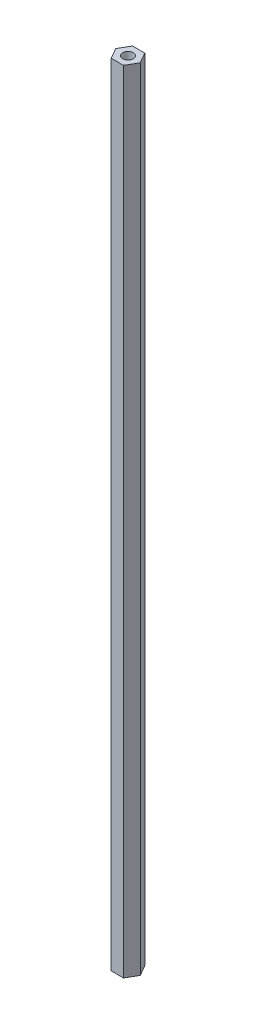
ISO-10303-21;
HEADER;
FILE_DESCRIPTION(('STEP AP214'),'2;1');
FILE_NAME('part.step','',(''),(''),'','','');
FILE_SCHEMA(('AUTOMOTIVE_DESIGN { 1 0 10303 214 1 1 1 1 }'));
ENDSEC;
DATA;
#1=APPLICATION_CONTEXT('core data for automotive mechanical design processes');
#2=APPLICATION_PROTOCOL_DEFINITION('international standard','automotive_design',2000,#1);
#3=PRODUCT_CONTEXT('',#1,'mechanical');
#4=PRODUCT('Part','Part','',(#3));
#5=PRODUCT_RELATED_PRODUCT_CATEGORY('part','',(#4));
#6=PRODUCT_DEFINITION_FORMATION('','',#4);
#7=PRODUCT_DEFINITION_CONTEXT('part definition',#1,'design');
#8=PRODUCT_DEFINITION('design','',#6,#7);
#9=PRODUCT_DEFINITION_SHAPE('','',#8);
#10=(LENGTH_UNIT() NAMED_UNIT(*) SI_UNIT(.MILLI.,.METRE.));
#11=(NAMED_UNIT(*) PLANE_ANGLE_UNIT() SI_UNIT($,.RADIAN.));
#12=(NAMED_UNIT(*) SI_UNIT($,.STERADIAN.) SOLID_ANGLE_UNIT());
#13=UNCERTAINTY_MEASURE_WITH_UNIT(LENGTH_MEASURE(1.E-05),#10,'distance_accuracy_value','');
#14=(GEOMETRIC_REPRESENTATION_CONTEXT(3) GLOBAL_UNCERTAINTY_ASSIGNED_CONTEXT((#13)) GLOBAL_UNIT_ASSIGNED_CONTEXT((#10,
#11,#12)) REPRESENTATION_CONTEXT('',''));
#15=CARTESIAN_POINT('',(0.,0.,0.));
#16=DIRECTION('',(0.,0.,1.));
#17=DIRECTION('',(1.,0.,0.));
#18=AXIS2_PLACEMENT_3D('',#15,#16,#17);
#19=CARTESIAN_POINT('',(0.,472.44,0.));
#20=DIRECTION('',(0.,1.,0.));
#21=DIRECTION('',(0.,0.,1.));
#22=AXIS2_PLACEMENT_3D('',#19,#20,#21);
#23=PLANE('',#22);
#24=DIRECTION('',(1.,0.,0.));
#25=VECTOR('',#24,1.);
#26=CARTESIAN_POINT('',(-3.66617420935413,472.44,6.35));
#27=LINE('',#26,#25);
#28=CARTESIAN_POINT('',(-3.66617420935413,472.44,6.35));
#29=VERTEX_POINT('',#28);
#30=CARTESIAN_POINT('',(3.66617420935412,472.44,6.35));
#31=VERTEX_POINT('',#30);
#32=EDGE_CURVE('E131',#29,#31,#27,.T.);
#33=ORIENTED_EDGE('',*,*,#32,.T.);
#34=DIRECTION('',(0.5,0.,-0.866025403784438));
#35=VECTOR('',#34,1.);
#36=CARTESIAN_POINT('',(3.66617420935412,472.44,6.35));
#37=LINE('',#36,#35);
#38=CARTESIAN_POINT('',(7.33234841870825,472.44,0.));
#39=VERTEX_POINT('',#38);
#40=EDGE_CURVE('E89',#31,#39,#37,.T.);
#41=ORIENTED_EDGE('',*,*,#40,.T.);
#42=DIRECTION('',(-0.5,0.,-0.866025403784439));
#43=VECTOR('',#42,1.);
#44=CARTESIAN_POINT('',(7.33234841870825,472.44,0.));
#45=LINE('',#44,#43);
#46=CARTESIAN_POINT('',(3.66617420935412,472.44,-6.35));
#47=VERTEX_POINT('',#46);
#48=EDGE_CURVE('E102',#39,#47,#45,.T.);
#49=ORIENTED_EDGE('',*,*,#48,.T.);
#50=DIRECTION('',(-1.,0.,0.));
#51=VECTOR('',#50,1.);
#52=CARTESIAN_POINT('',(3.66617420935412,472.44,-6.35));
#53=LINE('',#52,#51);
#54=CARTESIAN_POINT('',(-3.66617420935413,472.44,-6.35));
#55=VERTEX_POINT('',#54);
#56=EDGE_CURVE('E96',#47,#55,#53,.T.);
#57=ORIENTED_EDGE('',*,*,#56,.T.);
#58=DIRECTION('',(-0.5,0.,0.866025403784439));
#59=VECTOR('',#58,1.);
#60=CARTESIAN_POINT('',(-3.66617420935413,472.44,-6.35));
#61=LINE('',#60,#59);
#62=CARTESIAN_POINT('',(-7.33234841870825,472.44,0.));
#63=VERTEX_POINT('',#62);
#64=EDGE_CURVE('E100',#55,#63,#61,.T.);
#65=ORIENTED_EDGE('',*,*,#64,.T.);
#66=DIRECTION('',(0.5,0.,0.866025403784439));
#67=VECTOR('',#66,1.);
#68=CARTESIAN_POINT('',(-7.33234841870825,472.44,0.));
#69=LINE('',#68,#67);
#70=EDGE_CURVE('E52',#63,#29,#69,.T.);
#71=ORIENTED_EDGE('',*,*,#70,.T.);
#72=EDGE_LOOP('',(#33,#41,#49,#57,#65,#71));
#73=FACE_BOUND('',#72,.T.);
#74=CARTESIAN_POINT('',(0.,472.44,0.));
#75=DIRECTION('',(0.,1.,0.));
#76=DIRECTION('',(0.,0.,1.));
#77=AXIS2_PLACEMENT_3D('',#74,#75,#76);
#78=CIRCLE('',#77,3.175);
#79=CARTESIAN_POINT('',(0.,472.44,3.175));
#80=VERTEX_POINT('',#79);
#81=EDGE_CURVE('E124',#80,#80,#78,.T.);
#82=ORIENTED_EDGE('',*,*,#81,.F.);
#83=EDGE_LOOP('',(#82));
#84=FACE_BOUND('',#83,.T.);
#85=ADVANCED_FACE('F35',(#73,#84),#23,.T.);
#86=CARTESIAN_POINT('',(0.,0.,0.));
#87=DIRECTION('',(0.,1.,0.));
#88=DIRECTION('',(0.,0.,1.));
#89=AXIS2_PLACEMENT_3D('',#86,#87,#88);
#90=PLANE('',#89);
#91=DIRECTION('',(1.,0.,0.));
#92=VECTOR('',#91,1.);
#93=CARTESIAN_POINT('',(-3.66617420935413,0.,6.35));
#94=LINE('',#93,#92);
#95=CARTESIAN_POINT('',(-3.66617420935413,0.,6.35));
#96=VERTEX_POINT('',#95);
#97=CARTESIAN_POINT('',(3.66617420935412,0.,6.35));
#98=VERTEX_POINT('',#97);
#99=EDGE_CURVE('E120',#96,#98,#94,.T.);
#100=ORIENTED_EDGE('',*,*,#99,.F.);
#101=DIRECTION('',(0.5,0.,0.866025403784439));
#102=VECTOR('',#101,1.);
#103=CARTESIAN_POINT('',(-7.33234841870825,0.,0.));
#104=LINE('',#103,#102);
#105=CARTESIAN_POINT('',(-7.33234841870825,0.,0.));
#106=VERTEX_POINT('',#105);
#107=EDGE_CURVE('E81',#106,#96,#104,.T.);
#108=ORIENTED_EDGE('',*,*,#107,.F.);
#109=DIRECTION('',(-0.5,0.,0.866025403784439));
#110=VECTOR('',#109,1.);
#111=CARTESIAN_POINT('',(-3.66617420935413,0.,-6.35));
#112=LINE('',#111,#110);
#113=CARTESIAN_POINT('',(-3.66617420935413,0.,-6.35));
#114=VERTEX_POINT('',#113);
#115=EDGE_CURVE('E75',#114,#106,#112,.T.);
#116=ORIENTED_EDGE('',*,*,#115,.F.);
#117=DIRECTION('',(-1.,0.,0.));
#118=VECTOR('',#117,1.);
#119=CARTESIAN_POINT('',(3.66617420935412,0.,-6.35));
#120=LINE('',#119,#118);
#121=CARTESIAN_POINT('',(3.66617420935412,0.,-6.35));
#122=VERTEX_POINT('',#121);
#123=EDGE_CURVE('E110',#122,#114,#120,.T.);
#124=ORIENTED_EDGE('',*,*,#123,.F.);
#125=DIRECTION('',(-0.5,0.,-0.866025403784439));
#126=VECTOR('',#125,1.);
#127=CARTESIAN_POINT('',(7.33234841870825,0.,0.));
#128=LINE('',#127,#126);
#129=CARTESIAN_POINT('',(7.33234841870825,0.,0.));
#130=VERTEX_POINT('',#129);
#131=EDGE_CURVE('E126',#130,#122,#128,.T.);
#132=ORIENTED_EDGE('',*,*,#131,.F.);
#133=DIRECTION('',(0.5,0.,-0.866025403784438));
#134=VECTOR('',#133,1.);
#135=CARTESIAN_POINT('',(3.66617420935412,0.,6.35));
#136=LINE('',#135,#134);
#137=EDGE_CURVE('E123',#98,#130,#136,.T.);
#138=ORIENTED_EDGE('',*,*,#137,.F.);
#139=EDGE_LOOP('',(#100,#108,#116,#124,#132,#138));
#140=FACE_BOUND('',#139,.T.);
#141=CARTESIAN_POINT('',(0.,0.,0.));
#142=DIRECTION('',(0.,1.,0.));
#143=DIRECTION('',(0.,0.,1.));
#144=AXIS2_PLACEMENT_3D('',#141,#142,#143);
#145=CIRCLE('',#144,3.175);
#146=CARTESIAN_POINT('',(0.,0.,3.175));
#147=VERTEX_POINT('',#146);
#148=EDGE_CURVE('E224',#147,#147,#145,.T.);
#149=ORIENTED_EDGE('',*,*,#148,.T.);
#150=EDGE_LOOP('',(#149));
#151=FACE_BOUND('',#150,.T.);
#152=ADVANCED_FACE('F140',(#140,#151),#90,.F.);
#153=CARTESIAN_POINT('',(-3.66617420935413,472.44,6.35));
#154=DIRECTION('',(0.,0.,-1.));
#155=DIRECTION('',(-1.,0.,0.));
#156=AXIS2_PLACEMENT_3D('',#153,#154,#155);
#157=PLANE('',#156);
#158=ORIENTED_EDGE('',*,*,#99,.T.);
#159=DIRECTION('',(0.,-1.,0.));
#160=VECTOR('',#159,1.);
#161=CARTESIAN_POINT('',(3.66617420935412,472.44,6.35));
#162=LINE('',#161,#160);
#163=EDGE_CURVE('E11',#31,#98,#162,.T.);
#164=ORIENTED_EDGE('',*,*,#163,.F.);
#165=ORIENTED_EDGE('',*,*,#32,.F.);
#166=DIRECTION('',(0.,-1.,0.));
#167=VECTOR('',#166,1.);
#168=CARTESIAN_POINT('',(-3.66617420935413,472.44,6.35));
#169=LINE('',#168,#167);
#170=EDGE_CURVE('E116',#29,#96,#169,.T.);
#171=ORIENTED_EDGE('',*,*,#170,.T.);
#172=EDGE_LOOP('',(#158,#164,#165,#171));
#173=FACE_BOUND('',#172,.T.);
#174=ADVANCED_FACE('F37',(#173),#157,.F.);
#175=CARTESIAN_POINT('',(3.66617420935412,472.44,6.35));
#176=DIRECTION('',(-0.866025403784438,0.,-0.5));
#177=DIRECTION('',(-0.5,0.,0.866025403784438));
#178=AXIS2_PLACEMENT_3D('',#175,#176,#177);
#179=PLANE('',#178);
#180=ORIENTED_EDGE('',*,*,#137,.T.);
#181=DIRECTION('',(0.,-1.,0.));
#182=VECTOR('',#181,1.);
#183=CARTESIAN_POINT('',(7.33234841870825,472.44,0.));
#184=LINE('',#183,#182);
#185=EDGE_CURVE('E44',#39,#130,#184,.T.);
#186=ORIENTED_EDGE('',*,*,#185,.F.);
#187=ORIENTED_EDGE('',*,*,#40,.F.);
#188=ORIENTED_EDGE('',*,*,#163,.T.);
#189=EDGE_LOOP('',(#180,#186,#187,#188));
#190=FACE_BOUND('',#189,.T.);
#191=ADVANCED_FACE('F165',(#190),#179,.F.);
#192=CARTESIAN_POINT('',(7.33234841870825,472.44,0.));
#193=DIRECTION('',(-0.866025403784439,0.,0.5));
#194=DIRECTION('',(0.5,0.,0.866025403784439));
#195=AXIS2_PLACEMENT_3D('',#192,#193,#194);
#196=PLANE('',#195);
#197=ORIENTED_EDGE('',*,*,#131,.T.);
#198=DIRECTION('',(0.,-1.,0.));
#199=VECTOR('',#198,1.);
#200=CARTESIAN_POINT('',(3.66617420935412,472.44,-6.35));
#201=LINE('',#200,#199);
#202=EDGE_CURVE('E111',#47,#122,#201,.T.);
#203=ORIENTED_EDGE('',*,*,#202,.F.);
#204=ORIENTED_EDGE('',*,*,#48,.F.);
#205=ORIENTED_EDGE('',*,*,#185,.T.);
#206=EDGE_LOOP('',(#197,#203,#204,#205));
#207=FACE_BOUND('',#206,.T.);
#208=ADVANCED_FACE('F137',(#207),#196,.F.);
#209=CARTESIAN_POINT('',(3.66617420935412,472.44,-6.35));
#210=DIRECTION('',(0.,0.,1.));
#211=DIRECTION('',(1.,0.,0.));
#212=AXIS2_PLACEMENT_3D('',#209,#210,#211);
#213=PLANE('',#212);
#214=ORIENTED_EDGE('',*,*,#123,.T.);
#215=DIRECTION('',(0.,-1.,0.));
#216=VECTOR('',#215,1.);
#217=CARTESIAN_POINT('',(-3.66617420935413,472.44,-6.35));
#218=LINE('',#217,#216);
#219=EDGE_CURVE('E107',#55,#114,#218,.T.);
#220=ORIENTED_EDGE('',*,*,#219,.F.);
#221=ORIENTED_EDGE('',*,*,#56,.F.);
#222=ORIENTED_EDGE('',*,*,#202,.T.);
#223=EDGE_LOOP('',(#214,#220,#221,#222));
#224=FACE_BOUND('',#223,.T.);
#225=ADVANCED_FACE('F108',(#224),#213,.F.);
#226=CARTESIAN_POINT('',(-3.66617420935413,472.44,-6.35));
#227=DIRECTION('',(0.866025403784439,0.,0.5));
#228=DIRECTION('',(0.5,0.,-0.866025403784439));
#229=AXIS2_PLACEMENT_3D('',#226,#227,#228);
#230=PLANE('',#229);
#231=ORIENTED_EDGE('',*,*,#115,.T.);
#232=DIRECTION('',(0.,-1.,0.));
#233=VECTOR('',#232,1.);
#234=CARTESIAN_POINT('',(-7.33234841870825,472.44,0.));
#235=LINE('',#234,#233);
#236=EDGE_CURVE('E112',#63,#106,#235,.T.);
#237=ORIENTED_EDGE('',*,*,#236,.F.);
#238=ORIENTED_EDGE('',*,*,#64,.F.);
#239=ORIENTED_EDGE('',*,*,#219,.T.);
#240=EDGE_LOOP('',(#231,#237,#238,#239));
#241=FACE_BOUND('',#240,.T.);
#242=ADVANCED_FACE('F114',(#241),#230,.F.);
#243=CARTESIAN_POINT('',(-7.33234841870825,472.44,0.));
#244=DIRECTION('',(0.866025403784439,0.,-0.5));
#245=DIRECTION('',(-0.5,0.,-0.866025403784439));
#246=AXIS2_PLACEMENT_3D('',#243,#244,#245);
#247=PLANE('',#246);
#248=ORIENTED_EDGE('',*,*,#107,.T.);
#249=ORIENTED_EDGE('',*,*,#170,.F.);
#250=ORIENTED_EDGE('',*,*,#70,.F.);
#251=ORIENTED_EDGE('',*,*,#236,.T.);
#252=EDGE_LOOP('',(#248,#249,#250,#251));
#253=FACE_BOUND('',#252,.T.);
#254=ADVANCED_FACE('F145',(#253),#247,.F.);
#255=CARTESIAN_POINT('',(0.,472.44,0.));
#256=DIRECTION('',(0.,-1.,0.));
#257=DIRECTION('',(0.,0.,-1.));
#258=AXIS2_PLACEMENT_3D('',#255,#256,#257);
#259=CYLINDRICAL_SURFACE('',#258,3.175);
#260=ORIENTED_EDGE('',*,*,#81,.T.);
#261=EDGE_LOOP('',(#260));
#262=FACE_BOUND('',#261,.T.);
#263=ORIENTED_EDGE('',*,*,#148,.F.);
#264=EDGE_LOOP('',(#263));
#265=FACE_BOUND('',#264,.T.);
#266=ADVANCED_FACE('F147',(#262,#265),#259,.F.);
#267=CLOSED_SHELL('',(#85,#152,#174,#191,#208,#225,#242,#254,#266));
#268=MANIFOLD_SOLID_BREP('B2',#267);
#269=ADVANCED_BREP_SHAPE_REPRESENTATION('',(#18,#268),#14);
#270=SHAPE_DEFINITION_REPRESENTATION(#9,#269);
ENDSEC;
END-ISO-10303-21;
